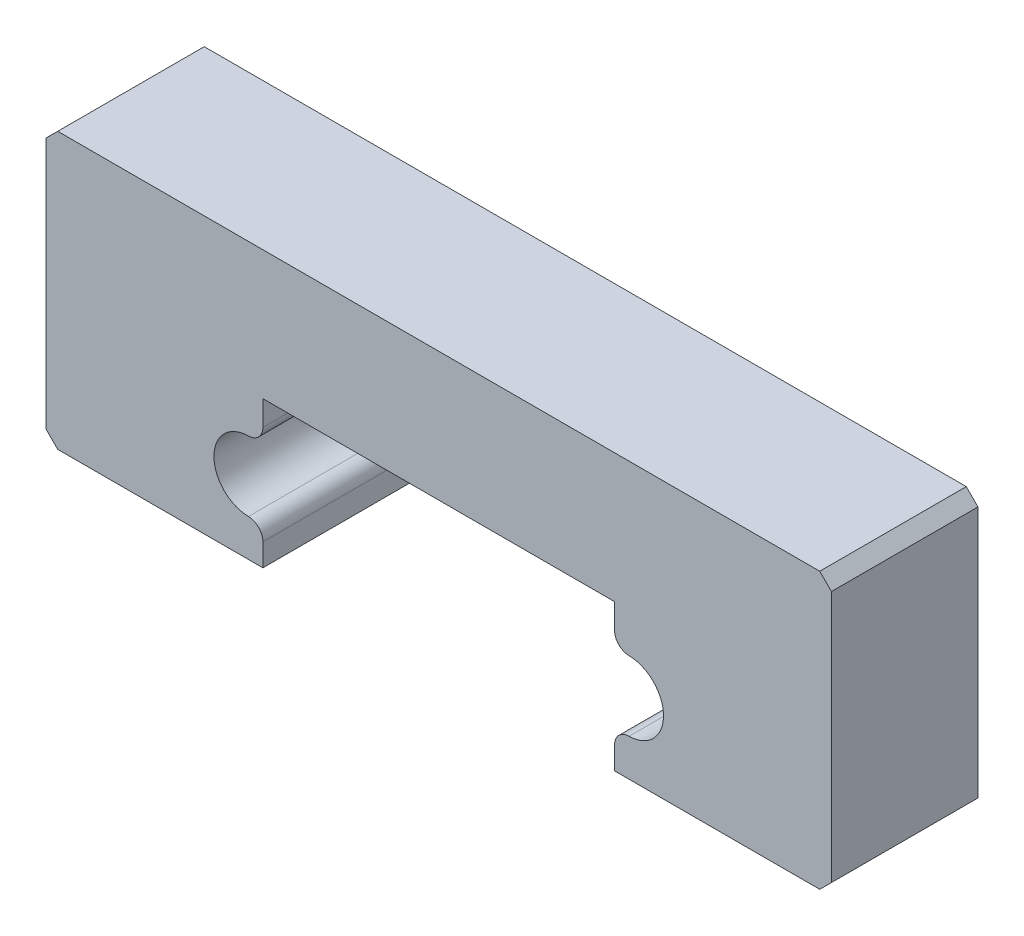
ISO-10303-21;
HEADER;
FILE_DESCRIPTION(('STEP AP214'),'2;1');
FILE_NAME('part.step','',(''),(''),'','','');
FILE_SCHEMA(('AUTOMOTIVE_DESIGN { 1 0 10303 214 1 1 1 1 }'));
ENDSEC;
DATA;
#1=APPLICATION_CONTEXT('core data for automotive mechanical design processes');
#2=APPLICATION_PROTOCOL_DEFINITION('international standard','automotive_design',2000,#1);
#3=PRODUCT_CONTEXT('',#1,'mechanical');
#4=PRODUCT('Part','Part','',(#3));
#5=PRODUCT_RELATED_PRODUCT_CATEGORY('part','',(#4));
#6=PRODUCT_DEFINITION_FORMATION('','',#4);
#7=PRODUCT_DEFINITION_CONTEXT('part definition',#1,'design');
#8=PRODUCT_DEFINITION('design','',#6,#7);
#9=PRODUCT_DEFINITION_SHAPE('','',#8);
#10=(LENGTH_UNIT() NAMED_UNIT(*) SI_UNIT(.MILLI.,.METRE.));
#11=(NAMED_UNIT(*) PLANE_ANGLE_UNIT() SI_UNIT($,.RADIAN.));
#12=(NAMED_UNIT(*) SI_UNIT($,.STERADIAN.) SOLID_ANGLE_UNIT());
#13=UNCERTAINTY_MEASURE_WITH_UNIT(LENGTH_MEASURE(1.E-05),#10,'distance_accuracy_value','');
#14=(GEOMETRIC_REPRESENTATION_CONTEXT(3) GLOBAL_UNCERTAINTY_ASSIGNED_CONTEXT((#13)) GLOBAL_UNIT_ASSIGNED_CONTEXT((#10,
#11,#12)) REPRESENTATION_CONTEXT('',''));
#15=CARTESIAN_POINT('',(0.,0.,0.));
#16=DIRECTION('',(0.,0.,1.));
#17=DIRECTION('',(1.,0.,0.));
#18=AXIS2_PLACEMENT_3D('',#15,#16,#17);
#19=CARTESIAN_POINT('',(-6.,-5.,5.));
#20=DIRECTION('',(-1.,0.,0.));
#21=DIRECTION('',(0.,-1.,0.));
#22=AXIS2_PLACEMENT_3D('',#19,#20,#21);
#23=PLANE('',#22);
#24=DIRECTION('',(0.,1.,0.));
#25=VECTOR('',#24,1.);
#26=CARTESIAN_POINT('',(-6.,-5.,0.));
#27=LINE('',#26,#25);
#28=CARTESIAN_POINT('',(-6.,-5.,0.));
#29=VERTEX_POINT('',#28);
#30=CARTESIAN_POINT('',(-6.,-4.22988165266092,0.));
#31=VERTEX_POINT('',#30);
#32=EDGE_CURVE('E247',#29,#31,#27,.T.);
#33=ORIENTED_EDGE('',*,*,#32,.T.);
#34=DIRECTION('',(0.,0.,-1.));
#35=VECTOR('',#34,1.);
#36=CARTESIAN_POINT('',(-6.,-4.22988165266092,5.));
#37=LINE('',#36,#35);
#38=CARTESIAN_POINT('',(-6.,-4.22988165266092,5.));
#39=VERTEX_POINT('',#38);
#40=EDGE_CURVE('E11',#31,#39,#37,.F.);
#41=ORIENTED_EDGE('',*,*,#40,.T.);
#42=DIRECTION('',(0.,1.,0.));
#43=VECTOR('',#42,1.);
#44=CARTESIAN_POINT('',(-6.,-5.,5.));
#45=LINE('',#44,#43);
#46=CARTESIAN_POINT('',(-6.,-5.,5.));
#47=VERTEX_POINT('',#46);
#48=EDGE_CURVE('E297',#47,#39,#45,.T.);
#49=ORIENTED_EDGE('',*,*,#48,.F.);
#50=DIRECTION('',(0.,0.,-1.));
#51=VECTOR('',#50,1.);
#52=CARTESIAN_POINT('',(-6.,-5.,5.));
#53=LINE('',#52,#51);
#54=EDGE_CURVE('E246',#47,#29,#53,.T.);
#55=ORIENTED_EDGE('',*,*,#54,.T.);
#56=EDGE_LOOP('',(#33,#41,#49,#55));
#57=FACE_BOUND('',#56,.T.);
#58=ADVANCED_FACE('F43',(#57),#23,.F.);
#59=CARTESIAN_POINT('',(-6.48,-2.54,5.));
#60=DIRECTION('',(0.,0.,-1.));
#61=DIRECTION('',(-1.,0.,0.));
#62=AXIS2_PLACEMENT_3D('',#59,#60,#61);
#63=CYLINDRICAL_SURFACE('',#62,1.19);
#64=CARTESIAN_POINT('',(-6.48,-2.54,0.));
#65=DIRECTION('',(0.,0.,-1.));
#66=DIRECTION('',(1.,0.,0.));
#67=AXIS2_PLACEMENT_3D('',#64,#65,#66);
#68=CIRCLE('',#67,1.19);
#69=CARTESIAN_POINT('',(-6.49408284023669,-3.72991666666657,0.));
#70=VERTEX_POINT('',#69);
#71=CARTESIAN_POINT('',(-6.49408284023669,-1.35008333333344,0.));
#72=VERTEX_POINT('',#71);
#73=EDGE_CURVE('E251',#70,#72,#68,.T.);
#74=ORIENTED_EDGE('',*,*,#73,.T.);
#75=DIRECTION('',(0.,0.,-1.));
#76=VECTOR('',#75,1.);
#77=CARTESIAN_POINT('',(-6.49408284023669,-1.35008333333344,5.));
#78=LINE('',#77,#76);
#79=CARTESIAN_POINT('',(-6.49408284023669,-1.35008333333344,5.));
#80=VERTEX_POINT('',#79);
#81=EDGE_CURVE('E52',#72,#80,#78,.F.);
#82=ORIENTED_EDGE('',*,*,#81,.T.);
#83=CARTESIAN_POINT('',(-6.48,-2.54,5.));
#84=DIRECTION('',(0.,0.,-1.));
#85=DIRECTION('',(1.,0.,0.));
#86=AXIS2_PLACEMENT_3D('',#83,#84,#85);
#87=CIRCLE('',#86,1.19);
#88=CARTESIAN_POINT('',(-6.49408284023669,-3.72991666666657,5.));
#89=VERTEX_POINT('',#88);
#90=EDGE_CURVE('E191',#89,#80,#87,.T.);
#91=ORIENTED_EDGE('',*,*,#90,.F.);
#92=DIRECTION('',(0.,0.,-1.));
#93=VECTOR('',#92,1.);
#94=CARTESIAN_POINT('',(-6.49408284023669,-3.72991666666657,5.));
#95=LINE('',#94,#93);
#96=EDGE_CURVE('E377',#89,#70,#95,.T.);
#97=ORIENTED_EDGE('',*,*,#96,.T.);
#98=EDGE_LOOP('',(#74,#82,#91,#97));
#99=FACE_BOUND('',#98,.T.);
#100=ADVANCED_FACE('F384',(#99),#63,.F.);
#101=CARTESIAN_POINT('',(-6.,0.,5.));
#102=DIRECTION('',(-1.,0.,0.));
#103=DIRECTION('',(0.,0.,1.));
#104=AXIS2_PLACEMENT_3D('',#101,#102,#103);
#105=PLANE('',#104);
#106=DIRECTION('',(0.,1.,0.));
#107=VECTOR('',#106,1.);
#108=CARTESIAN_POINT('',(-6.,0.,5.));
#109=LINE('',#108,#107);
#110=CARTESIAN_POINT('',(-6.,-0.850118347339082,5.));
#111=VERTEX_POINT('',#110);
#112=CARTESIAN_POINT('',(-6.,0.,5.));
#113=VERTEX_POINT('',#112);
#114=EDGE_CURVE('E180',#111,#113,#109,.T.);
#115=ORIENTED_EDGE('',*,*,#114,.F.);
#116=DIRECTION('',(0.,0.,-1.));
#117=VECTOR('',#116,1.);
#118=CARTESIAN_POINT('',(-6.,-0.850118347339082,5.));
#119=LINE('',#118,#117);
#120=CARTESIAN_POINT('',(-6.,-0.850118347339082,0.));
#121=VERTEX_POINT('',#120);
#122=EDGE_CURVE('E374',#111,#121,#119,.T.);
#123=ORIENTED_EDGE('',*,*,#122,.T.);
#124=DIRECTION('',(0.,1.,0.));
#125=VECTOR('',#124,1.);
#126=CARTESIAN_POINT('',(-6.,0.,0.));
#127=LINE('',#126,#125);
#128=CARTESIAN_POINT('',(-6.,0.,0.));
#129=VERTEX_POINT('',#128);
#130=EDGE_CURVE('E197',#121,#129,#127,.T.);
#131=ORIENTED_EDGE('',*,*,#130,.T.);
#132=DIRECTION('',(0.,0.,-1.));
#133=VECTOR('',#132,1.);
#134=CARTESIAN_POINT('',(-6.,0.,5.));
#135=LINE('',#134,#133);
#136=EDGE_CURVE('E194',#113,#129,#135,.T.);
#137=ORIENTED_EDGE('',*,*,#136,.F.);
#138=EDGE_LOOP('',(#115,#123,#131,#137));
#139=FACE_BOUND('',#138,.T.);
#140=ADVANCED_FACE('F195',(#139),#105,.F.);
#141=CARTESIAN_POINT('',(6.,0.,5.));
#142=DIRECTION('',(0.,1.,0.));
#143=DIRECTION('',(-1.,0.,0.));
#144=AXIS2_PLACEMENT_3D('',#141,#142,#143);
#145=PLANE('',#144);
#146=DIRECTION('',(1.,0.,0.));
#147=VECTOR('',#146,1.);
#148=CARTESIAN_POINT('',(6.,0.,0.));
#149=LINE('',#148,#147);
#150=CARTESIAN_POINT('',(6.,0.,0.));
#151=VERTEX_POINT('',#150);
#152=EDGE_CURVE('E257',#129,#151,#149,.T.);
#153=ORIENTED_EDGE('',*,*,#152,.T.);
#154=DIRECTION('',(0.,0.,-1.));
#155=VECTOR('',#154,1.);
#156=CARTESIAN_POINT('',(6.,0.,5.));
#157=LINE('',#156,#155);
#158=CARTESIAN_POINT('',(6.,0.,5.));
#159=VERTEX_POINT('',#158);
#160=EDGE_CURVE('E202',#159,#151,#157,.T.);
#161=ORIENTED_EDGE('',*,*,#160,.F.);
#162=DIRECTION('',(1.,0.,0.));
#163=VECTOR('',#162,1.);
#164=CARTESIAN_POINT('',(6.,0.,5.));
#165=LINE('',#164,#163);
#166=EDGE_CURVE('E185',#113,#159,#165,.T.);
#167=ORIENTED_EDGE('',*,*,#166,.F.);
#168=ORIENTED_EDGE('',*,*,#136,.T.);
#169=EDGE_LOOP('',(#153,#161,#167,#168));
#170=FACE_BOUND('',#169,.T.);
#171=ADVANCED_FACE('F204',(#170),#145,.F.);
#172=CARTESIAN_POINT('',(6.,0.,5.));
#173=DIRECTION('',(1.,0.,0.));
#174=DIRECTION('',(0.,0.,-1.));
#175=AXIS2_PLACEMENT_3D('',#172,#173,#174);
#176=PLANE('',#175);
#177=DIRECTION('',(0.,-1.,0.));
#178=VECTOR('',#177,1.);
#179=CARTESIAN_POINT('',(6.,0.,0.));
#180=LINE('',#179,#178);
#181=CARTESIAN_POINT('',(6.,-0.850118347339077,0.));
#182=VERTEX_POINT('',#181);
#183=EDGE_CURVE('E260',#151,#182,#180,.T.);
#184=ORIENTED_EDGE('',*,*,#183,.T.);
#185=DIRECTION('',(0.,0.,-1.));
#186=VECTOR('',#185,1.);
#187=CARTESIAN_POINT('',(6.,-0.850118347339077,5.));
#188=LINE('',#187,#186);
#189=CARTESIAN_POINT('',(6.,-0.850118347339077,5.));
#190=VERTEX_POINT('',#189);
#191=EDGE_CURVE('E59',#182,#190,#188,.F.);
#192=ORIENTED_EDGE('',*,*,#191,.T.);
#193=DIRECTION('',(0.,-1.,0.));
#194=VECTOR('',#193,1.);
#195=CARTESIAN_POINT('',(6.,0.,5.));
#196=LINE('',#195,#194);
#197=EDGE_CURVE('E207',#159,#190,#196,.T.);
#198=ORIENTED_EDGE('',*,*,#197,.F.);
#199=ORIENTED_EDGE('',*,*,#160,.T.);
#200=EDGE_LOOP('',(#184,#192,#198,#199));
#201=FACE_BOUND('',#200,.T.);
#202=ADVANCED_FACE('F396',(#201),#176,.F.);
#203=CARTESIAN_POINT('',(6.48,-2.54,5.));
#204=DIRECTION('',(0.,0.,-1.));
#205=DIRECTION('',(-1.,0.,0.));
#206=AXIS2_PLACEMENT_3D('',#203,#204,#205);
#207=CYLINDRICAL_SURFACE('',#206,1.19);
#208=CARTESIAN_POINT('',(6.48,-2.54,0.));
#209=DIRECTION('',(0.,0.,-1.));
#210=DIRECTION('',(-1.,0.,0.));
#211=AXIS2_PLACEMENT_3D('',#208,#209,#210);
#212=CIRCLE('',#211,1.19);
#213=CARTESIAN_POINT('',(6.49408284023669,-1.35008333333343,0.));
#214=VERTEX_POINT('',#213);
#215=CARTESIAN_POINT('',(6.49408284023669,-3.72991666666656,0.));
#216=VERTEX_POINT('',#215);
#217=EDGE_CURVE('E263',#214,#216,#212,.T.);
#218=ORIENTED_EDGE('',*,*,#217,.T.);
#219=DIRECTION('',(0.,0.,-1.));
#220=VECTOR('',#219,1.);
#221=CARTESIAN_POINT('',(6.49408284023669,-3.72991666666656,5.));
#222=LINE('',#221,#220);
#223=CARTESIAN_POINT('',(6.49408284023669,-3.72991666666656,5.));
#224=VERTEX_POINT('',#223);
#225=EDGE_CURVE('E358',#216,#224,#222,.F.);
#226=ORIENTED_EDGE('',*,*,#225,.T.);
#227=CARTESIAN_POINT('',(6.48,-2.54,5.));
#228=DIRECTION('',(0.,0.,-1.));
#229=DIRECTION('',(-1.,0.,0.));
#230=AXIS2_PLACEMENT_3D('',#227,#228,#229);
#231=CIRCLE('',#230,1.19);
#232=CARTESIAN_POINT('',(6.49408284023669,-1.35008333333343,5.));
#233=VERTEX_POINT('',#232);
#234=EDGE_CURVE('E210',#233,#224,#231,.T.);
#235=ORIENTED_EDGE('',*,*,#234,.F.);
#236=DIRECTION('',(0.,0.,-1.));
#237=VECTOR('',#236,1.);
#238=CARTESIAN_POINT('',(6.49408284023669,-1.35008333333343,5.));
#239=LINE('',#238,#237);
#240=EDGE_CURVE('E354',#233,#214,#239,.T.);
#241=ORIENTED_EDGE('',*,*,#240,.T.);
#242=EDGE_LOOP('',(#218,#226,#235,#241));
#243=FACE_BOUND('',#242,.T.);
#244=ADVANCED_FACE('F404',(#243),#207,.F.);
#245=CARTESIAN_POINT('',(6.,-5.,5.));
#246=DIRECTION('',(1.,0.,0.));
#247=DIRECTION('',(0.,1.,0.));
#248=AXIS2_PLACEMENT_3D('',#245,#246,#247);
#249=PLANE('',#248);
#250=DIRECTION('',(0.,-1.,0.));
#251=VECTOR('',#250,1.);
#252=CARTESIAN_POINT('',(6.,-5.,5.));
#253=LINE('',#252,#251);
#254=CARTESIAN_POINT('',(6.,-4.22988165266092,5.));
#255=VERTEX_POINT('',#254);
#256=CARTESIAN_POINT('',(6.,-5.,5.));
#257=VERTEX_POINT('',#256);
#258=EDGE_CURVE('E216',#255,#257,#253,.T.);
#259=ORIENTED_EDGE('',*,*,#258,.F.);
#260=DIRECTION('',(0.,0.,-1.));
#261=VECTOR('',#260,1.);
#262=CARTESIAN_POINT('',(6.,-4.22988165266092,5.));
#263=LINE('',#262,#261);
#264=CARTESIAN_POINT('',(6.,-4.22988165266092,0.));
#265=VERTEX_POINT('',#264);
#266=EDGE_CURVE('E201',#255,#265,#263,.T.);
#267=ORIENTED_EDGE('',*,*,#266,.T.);
#268=DIRECTION('',(0.,-1.,0.));
#269=VECTOR('',#268,1.);
#270=CARTESIAN_POINT('',(6.,-5.,0.));
#271=LINE('',#270,#269);
#272=CARTESIAN_POINT('',(6.,-5.,0.));
#273=VERTEX_POINT('',#272);
#274=EDGE_CURVE('E267',#265,#273,#271,.T.);
#275=ORIENTED_EDGE('',*,*,#274,.T.);
#276=DIRECTION('',(0.,0.,-1.));
#277=VECTOR('',#276,1.);
#278=CARTESIAN_POINT('',(6.,-5.,5.));
#279=LINE('',#278,#277);
#280=EDGE_CURVE('E333',#257,#273,#279,.T.);
#281=ORIENTED_EDGE('',*,*,#280,.F.);
#282=EDGE_LOOP('',(#259,#267,#275,#281));
#283=FACE_BOUND('',#282,.T.);
#284=ADVANCED_FACE('F413',(#283),#249,.F.);
#285=CARTESIAN_POINT('',(6.,-5.,5.));
#286=DIRECTION('',(0.,1.,0.));
#287=DIRECTION('',(-1.,0.,0.));
#288=AXIS2_PLACEMENT_3D('',#285,#286,#287);
#289=PLANE('',#288);
#290=DIRECTION('',(1.,0.,0.));
#291=VECTOR('',#290,1.);
#292=CARTESIAN_POINT('',(6.,-5.,0.));
#293=LINE('',#292,#291);
#294=CARTESIAN_POINT('',(13.,-4.99999999999999,0.));
#295=VERTEX_POINT('',#294);
#296=EDGE_CURVE('E270',#273,#295,#293,.T.);
#297=ORIENTED_EDGE('',*,*,#296,.T.);
#298=DIRECTION('',(0.,0.,-1.));
#299=VECTOR('',#298,1.);
#300=CARTESIAN_POINT('',(13.,-4.99999999999999,5.));
#301=LINE('',#300,#299);
#302=CARTESIAN_POINT('',(13.,-4.99999999999999,5.));
#303=VERTEX_POINT('',#302);
#304=EDGE_CURVE('E329',#303,#295,#301,.T.);
#305=ORIENTED_EDGE('',*,*,#304,.F.);
#306=DIRECTION('',(1.,0.,0.));
#307=VECTOR('',#306,1.);
#308=CARTESIAN_POINT('',(6.,-5.,5.));
#309=LINE('',#308,#307);
#310=EDGE_CURVE('E219',#257,#303,#309,.T.);
#311=ORIENTED_EDGE('',*,*,#310,.F.);
#312=ORIENTED_EDGE('',*,*,#280,.T.);
#313=EDGE_LOOP('',(#297,#305,#311,#312));
#314=FACE_BOUND('',#313,.T.);
#315=ADVANCED_FACE('F420',(#314),#289,.F.);
#316=CARTESIAN_POINT('',(13.,-4.99999999999999,5.));
#317=DIRECTION('',(-0.707106781186548,0.707106781186548,0.));
#318=DIRECTION('',(-0.707106781186548,-0.707106781186548,0.));
#319=AXIS2_PLACEMENT_3D('',#316,#317,#318);
#320=PLANE('',#319);
#321=DIRECTION('',(0.707106781186547,0.707106781186547,0.));
#322=VECTOR('',#321,1.);
#323=CARTESIAN_POINT('',(13.,-4.99999999999999,0.));
#324=LINE('',#323,#322);
#325=CARTESIAN_POINT('',(13.4,-4.59999999999999,0.));
#326=VERTEX_POINT('',#325);
#327=EDGE_CURVE('E273',#295,#326,#324,.T.);
#328=ORIENTED_EDGE('',*,*,#327,.T.);
#329=DIRECTION('',(0.,0.,-1.));
#330=VECTOR('',#329,1.);
#331=CARTESIAN_POINT('',(13.4,-4.59999999999999,5.));
#332=LINE('',#331,#330);
#333=CARTESIAN_POINT('',(13.4,-4.59999999999999,5.));
#334=VERTEX_POINT('',#333);
#335=EDGE_CURVE('E325',#334,#326,#332,.T.);
#336=ORIENTED_EDGE('',*,*,#335,.F.);
#337=DIRECTION('',(0.707106781186547,0.707106781186547,0.));
#338=VECTOR('',#337,1.);
#339=CARTESIAN_POINT('',(13.,-4.99999999999999,5.));
#340=LINE('',#339,#338);
#341=EDGE_CURVE('E222',#303,#334,#340,.T.);
#342=ORIENTED_EDGE('',*,*,#341,.F.);
#343=ORIENTED_EDGE('',*,*,#304,.T.);
#344=EDGE_LOOP('',(#328,#336,#342,#343));
#345=FACE_BOUND('',#344,.T.);
#346=ADVANCED_FACE('F423',(#345),#320,.F.);
#347=CARTESIAN_POINT('',(13.4,-4.59999999999999,5.));
#348=DIRECTION('',(-1.,0.,0.));
#349=DIRECTION('',(0.,-1.,0.));
#350=AXIS2_PLACEMENT_3D('',#347,#348,#349);
#351=PLANE('',#350);
#352=DIRECTION('',(0.,1.,0.));
#353=VECTOR('',#352,1.);
#354=CARTESIAN_POINT('',(13.4,-4.59999999999999,0.));
#355=LINE('',#354,#353);
#356=CARTESIAN_POINT('',(13.4,4.00000000000001,0.));
#357=VERTEX_POINT('',#356);
#358=EDGE_CURVE('E276',#326,#357,#355,.T.);
#359=ORIENTED_EDGE('',*,*,#358,.T.);
#360=DIRECTION('',(0.,0.,-1.));
#361=VECTOR('',#360,1.);
#362=CARTESIAN_POINT('',(13.4,4.00000000000001,5.));
#363=LINE('',#362,#361);
#364=CARTESIAN_POINT('',(13.4,4.00000000000001,5.));
#365=VERTEX_POINT('',#364);
#366=EDGE_CURVE('E321',#365,#357,#363,.T.);
#367=ORIENTED_EDGE('',*,*,#366,.F.);
#368=DIRECTION('',(0.,1.,0.));
#369=VECTOR('',#368,1.);
#370=CARTESIAN_POINT('',(13.4,-4.59999999999999,5.));
#371=LINE('',#370,#369);
#372=EDGE_CURVE('E225',#334,#365,#371,.T.);
#373=ORIENTED_EDGE('',*,*,#372,.F.);
#374=ORIENTED_EDGE('',*,*,#335,.T.);
#375=EDGE_LOOP('',(#359,#367,#373,#374));
#376=FACE_BOUND('',#375,.T.);
#377=ADVANCED_FACE('F428',(#376),#351,.F.);
#378=CARTESIAN_POINT('',(13.4,4.00000000000001,5.));
#379=DIRECTION('',(-0.707106781186548,-0.707106781186548,0.));
#380=DIRECTION('',(0.707106781186548,-0.707106781186548,0.));
#381=AXIS2_PLACEMENT_3D('',#378,#379,#380);
#382=PLANE('',#381);
#383=DIRECTION('',(-0.707106781186547,0.707106781186547,0.));
#384=VECTOR('',#383,1.);
#385=CARTESIAN_POINT('',(13.4,4.00000000000001,0.));
#386=LINE('',#385,#384);
#387=CARTESIAN_POINT('',(13.,4.40000000000001,0.));
#388=VERTEX_POINT('',#387);
#389=EDGE_CURVE('E279',#357,#388,#386,.T.);
#390=ORIENTED_EDGE('',*,*,#389,.T.);
#391=DIRECTION('',(0.,0.,-1.));
#392=VECTOR('',#391,1.);
#393=CARTESIAN_POINT('',(13.,4.40000000000001,5.));
#394=LINE('',#393,#392);
#395=CARTESIAN_POINT('',(13.,4.40000000000001,5.));
#396=VERTEX_POINT('',#395);
#397=EDGE_CURVE('E317',#396,#388,#394,.T.);
#398=ORIENTED_EDGE('',*,*,#397,.F.);
#399=DIRECTION('',(-0.707106781186547,0.707106781186547,0.));
#400=VECTOR('',#399,1.);
#401=CARTESIAN_POINT('',(13.4,4.00000000000001,5.));
#402=LINE('',#401,#400);
#403=EDGE_CURVE('E228',#365,#396,#402,.T.);
#404=ORIENTED_EDGE('',*,*,#403,.F.);
#405=ORIENTED_EDGE('',*,*,#366,.T.);
#406=EDGE_LOOP('',(#390,#398,#404,#405));
#407=FACE_BOUND('',#406,.T.);
#408=ADVANCED_FACE('F434',(#407),#382,.F.);
#409=CARTESIAN_POINT('',(-13.,4.4,5.));
#410=DIRECTION('',(0.,-1.,0.));
#411=DIRECTION('',(1.,0.,0.));
#412=AXIS2_PLACEMENT_3D('',#409,#410,#411);
#413=PLANE('',#412);
#414=DIRECTION('',(-1.,0.,0.));
#415=VECTOR('',#414,1.);
#416=CARTESIAN_POINT('',(-13.,4.4,0.));
#417=LINE('',#416,#415);
#418=CARTESIAN_POINT('',(-13.,4.4,0.));
#419=VERTEX_POINT('',#418);
#420=EDGE_CURVE('E282',#388,#419,#417,.T.);
#421=ORIENTED_EDGE('',*,*,#420,.T.);
#422=DIRECTION('',(0.,0.,-1.));
#423=VECTOR('',#422,1.);
#424=CARTESIAN_POINT('',(-13.,4.4,5.));
#425=LINE('',#424,#423);
#426=CARTESIAN_POINT('',(-13.,4.4,5.));
#427=VERTEX_POINT('',#426);
#428=EDGE_CURVE('E313',#427,#419,#425,.T.);
#429=ORIENTED_EDGE('',*,*,#428,.F.);
#430=DIRECTION('',(-1.,0.,0.));
#431=VECTOR('',#430,1.);
#432=CARTESIAN_POINT('',(-13.,4.4,5.));
#433=LINE('',#432,#431);
#434=EDGE_CURVE('E231',#396,#427,#433,.T.);
#435=ORIENTED_EDGE('',*,*,#434,.F.);
#436=ORIENTED_EDGE('',*,*,#397,.T.);
#437=EDGE_LOOP('',(#421,#429,#435,#436));
#438=FACE_BOUND('',#437,.T.);
#439=ADVANCED_FACE('F438',(#438),#413,.F.);
#440=CARTESIAN_POINT('',(-13.4,4.,5.));
#441=DIRECTION('',(0.707106781186548,-0.707106781186547,0.));
#442=DIRECTION('',(0.707106781186547,0.707106781186548,0.));
#443=AXIS2_PLACEMENT_3D('',#440,#441,#442);
#444=PLANE('',#443);
#445=DIRECTION('',(-0.707106781186547,-0.707106781186548,0.));
#446=VECTOR('',#445,1.);
#447=CARTESIAN_POINT('',(-13.4,4.,0.));
#448=LINE('',#447,#446);
#449=CARTESIAN_POINT('',(-13.4,4.,0.));
#450=VERTEX_POINT('',#449);
#451=EDGE_CURVE('E285',#419,#450,#448,.T.);
#452=ORIENTED_EDGE('',*,*,#451,.T.);
#453=DIRECTION('',(0.,0.,-1.));
#454=VECTOR('',#453,1.);
#455=CARTESIAN_POINT('',(-13.4,4.,5.));
#456=LINE('',#455,#454);
#457=CARTESIAN_POINT('',(-13.4,4.,5.));
#458=VERTEX_POINT('',#457);
#459=EDGE_CURVE('E309',#458,#450,#456,.T.);
#460=ORIENTED_EDGE('',*,*,#459,.F.);
#461=DIRECTION('',(-0.707106781186547,-0.707106781186548,0.));
#462=VECTOR('',#461,1.);
#463=CARTESIAN_POINT('',(-13.4,4.,5.));
#464=LINE('',#463,#462);
#465=EDGE_CURVE('E234',#427,#458,#464,.T.);
#466=ORIENTED_EDGE('',*,*,#465,.F.);
#467=ORIENTED_EDGE('',*,*,#428,.T.);
#468=EDGE_LOOP('',(#452,#460,#466,#467));
#469=FACE_BOUND('',#468,.T.);
#470=ADVANCED_FACE('F443',(#469),#444,.F.);
#471=CARTESIAN_POINT('',(-13.4,-4.6,5.));
#472=DIRECTION('',(1.,0.,0.));
#473=DIRECTION('',(0.,0.,-1.));
#474=AXIS2_PLACEMENT_3D('',#471,#472,#473);
#475=PLANE('',#474);
#476=DIRECTION('',(0.,-1.,0.));
#477=VECTOR('',#476,1.);
#478=CARTESIAN_POINT('',(-13.4,-4.6,0.));
#479=LINE('',#478,#477);
#480=CARTESIAN_POINT('',(-13.4,-4.6,0.));
#481=VERTEX_POINT('',#480);
#482=EDGE_CURVE('E288',#450,#481,#479,.T.);
#483=ORIENTED_EDGE('',*,*,#482,.T.);
#484=DIRECTION('',(0.,0.,-1.));
#485=VECTOR('',#484,1.);
#486=CARTESIAN_POINT('',(-13.4,-4.6,5.));
#487=LINE('',#486,#485);
#488=CARTESIAN_POINT('',(-13.4,-4.6,5.));
#489=VERTEX_POINT('',#488);
#490=EDGE_CURVE('E305',#489,#481,#487,.T.);
#491=ORIENTED_EDGE('',*,*,#490,.F.);
#492=DIRECTION('',(0.,-1.,0.));
#493=VECTOR('',#492,1.);
#494=CARTESIAN_POINT('',(-13.4,-4.6,5.));
#495=LINE('',#494,#493);
#496=EDGE_CURVE('E237',#458,#489,#495,.T.);
#497=ORIENTED_EDGE('',*,*,#496,.F.);
#498=ORIENTED_EDGE('',*,*,#459,.T.);
#499=EDGE_LOOP('',(#483,#491,#497,#498));
#500=FACE_BOUND('',#499,.T.);
#501=ADVANCED_FACE('F449',(#500),#475,.F.);
#502=CARTESIAN_POINT('',(-13.,-5.,5.));
#503=DIRECTION('',(0.707106781186548,0.707106781186548,0.));
#504=DIRECTION('',(-0.707106781186548,0.707106781186548,0.));
#505=AXIS2_PLACEMENT_3D('',#502,#503,#504);
#506=PLANE('',#505);
#507=DIRECTION('',(0.707106781186547,-0.707106781186547,0.));
#508=VECTOR('',#507,1.);
#509=CARTESIAN_POINT('',(-13.,-5.,0.));
#510=LINE('',#509,#508);
#511=CARTESIAN_POINT('',(-13.,-5.,0.));
#512=VERTEX_POINT('',#511);
#513=EDGE_CURVE('E291',#481,#512,#510,.T.);
#514=ORIENTED_EDGE('',*,*,#513,.T.);
#515=DIRECTION('',(0.,0.,-1.));
#516=VECTOR('',#515,1.);
#517=CARTESIAN_POINT('',(-13.,-5.,5.));
#518=LINE('',#517,#516);
#519=CARTESIAN_POINT('',(-13.,-5.,5.));
#520=VERTEX_POINT('',#519);
#521=EDGE_CURVE('E301',#520,#512,#518,.T.);
#522=ORIENTED_EDGE('',*,*,#521,.F.);
#523=DIRECTION('',(0.707106781186547,-0.707106781186547,0.));
#524=VECTOR('',#523,1.);
#525=CARTESIAN_POINT('',(-13.,-5.,5.));
#526=LINE('',#525,#524);
#527=EDGE_CURVE('E240',#489,#520,#526,.T.);
#528=ORIENTED_EDGE('',*,*,#527,.F.);
#529=ORIENTED_EDGE('',*,*,#490,.T.);
#530=EDGE_LOOP('',(#514,#522,#528,#529));
#531=FACE_BOUND('',#530,.T.);
#532=ADVANCED_FACE('F453',(#531),#506,.F.);
#533=CARTESIAN_POINT('',(-6.,-5.,5.));
#534=DIRECTION('',(0.,1.,0.));
#535=DIRECTION('',(-1.,0.,0.));
#536=AXIS2_PLACEMENT_3D('',#533,#534,#535);
#537=PLANE('',#536);
#538=DIRECTION('',(1.,0.,0.));
#539=VECTOR('',#538,1.);
#540=CARTESIAN_POINT('',(-6.,-5.,0.));
#541=LINE('',#540,#539);
#542=EDGE_CURVE('E294',#512,#29,#541,.T.);
#543=ORIENTED_EDGE('',*,*,#542,.T.);
#544=ORIENTED_EDGE('',*,*,#54,.F.);
#545=DIRECTION('',(1.,0.,0.));
#546=VECTOR('',#545,1.);
#547=CARTESIAN_POINT('',(-6.,-5.,5.));
#548=LINE('',#547,#546);
#549=EDGE_CURVE('E243',#520,#47,#548,.T.);
#550=ORIENTED_EDGE('',*,*,#549,.F.);
#551=ORIENTED_EDGE('',*,*,#521,.T.);
#552=EDGE_LOOP('',(#543,#544,#550,#551));
#553=FACE_BOUND('',#552,.T.);
#554=ADVANCED_FACE('F458',(#553),#537,.F.);
#555=CARTESIAN_POINT('',(-6.48,-2.54,5.));
#556=DIRECTION('',(0.,0.,1.));
#557=DIRECTION('',(1.,0.,0.));
#558=AXIS2_PLACEMENT_3D('',#555,#556,#557);
#559=PLANE('',#558);
#560=ORIENTED_EDGE('',*,*,#234,.T.);
#561=CARTESIAN_POINT('',(6.5,-4.22988165266092,5.));
#562=DIRECTION('',(0.,0.,1.));
#563=DIRECTION('',(1.,0.,0.));
#564=AXIS2_PLACEMENT_3D('',#561,#562,#563);
#565=CIRCLE('',#564,0.5);
#566=EDGE_CURVE('E369',#224,#255,#565,.T.);
#567=ORIENTED_EDGE('',*,*,#566,.T.);
#568=ORIENTED_EDGE('',*,*,#258,.T.);
#569=ORIENTED_EDGE('',*,*,#310,.T.);
#570=ORIENTED_EDGE('',*,*,#341,.T.);
#571=ORIENTED_EDGE('',*,*,#372,.T.);
#572=ORIENTED_EDGE('',*,*,#403,.T.);
#573=ORIENTED_EDGE('',*,*,#434,.T.);
#574=ORIENTED_EDGE('',*,*,#465,.T.);
#575=ORIENTED_EDGE('',*,*,#496,.T.);
#576=ORIENTED_EDGE('',*,*,#527,.T.);
#577=ORIENTED_EDGE('',*,*,#549,.T.);
#578=ORIENTED_EDGE('',*,*,#48,.T.);
#579=CARTESIAN_POINT('',(-6.5,-4.22988165266092,5.));
#580=DIRECTION('',(0.,0.,1.));
#581=DIRECTION('',(1.,0.,0.));
#582=AXIS2_PLACEMENT_3D('',#579,#580,#581);
#583=CIRCLE('',#582,0.5);
#584=EDGE_CURVE('E361',#39,#89,#583,.T.);
#585=ORIENTED_EDGE('',*,*,#584,.T.);
#586=ORIENTED_EDGE('',*,*,#90,.T.);
#587=CARTESIAN_POINT('',(-6.5,-0.850118347339082,5.));
#588=DIRECTION('',(0.,0.,1.));
#589=DIRECTION('',(1.,0.,0.));
#590=AXIS2_PLACEMENT_3D('',#587,#588,#589);
#591=CIRCLE('',#590,0.5);
#592=EDGE_CURVE('E67',#80,#111,#591,.T.);
#593=ORIENTED_EDGE('',*,*,#592,.T.);
#594=ORIENTED_EDGE('',*,*,#114,.T.);
#595=ORIENTED_EDGE('',*,*,#166,.T.);
#596=ORIENTED_EDGE('',*,*,#197,.T.);
#597=CARTESIAN_POINT('',(6.5,-0.850118347339077,5.));
#598=DIRECTION('',(0.,0.,1.));
#599=DIRECTION('',(1.,0.,0.));
#600=AXIS2_PLACEMENT_3D('',#597,#598,#599);
#601=CIRCLE('',#600,0.5);
#602=EDGE_CURVE('E366',#190,#233,#601,.T.);
#603=ORIENTED_EDGE('',*,*,#602,.T.);
#604=EDGE_LOOP('',(#560,#567,#568,#569,#570,#571,#572,#573,#574,#575,#576,#577,#578,#585,#586,
#593,#594,#595,#596,#603));
#605=FACE_BOUND('',#604,.T.);
#606=ADVANCED_FACE('F183',(#605),#559,.T.);
#607=CARTESIAN_POINT('',(-6.48,-2.54,0.));
#608=DIRECTION('',(0.,0.,1.));
#609=DIRECTION('',(1.,0.,0.));
#610=AXIS2_PLACEMENT_3D('',#607,#608,#609);
#611=PLANE('',#610);
#612=ORIENTED_EDGE('',*,*,#274,.F.);
#613=CARTESIAN_POINT('',(6.5,-4.22988165266092,0.));
#614=DIRECTION('',(0.,0.,1.));
#615=DIRECTION('',(1.,0.,0.));
#616=AXIS2_PLACEMENT_3D('',#613,#614,#615);
#617=CIRCLE('',#616,0.5);
#618=EDGE_CURVE('E351',#265,#216,#617,.F.);
#619=ORIENTED_EDGE('',*,*,#618,.T.);
#620=ORIENTED_EDGE('',*,*,#217,.F.);
#621=CARTESIAN_POINT('',(6.5,-0.850118347339077,0.));
#622=DIRECTION('',(0.,0.,1.));
#623=DIRECTION('',(1.,0.,0.));
#624=AXIS2_PLACEMENT_3D('',#621,#622,#623);
#625=CIRCLE('',#624,0.5);
#626=EDGE_CURVE('E348',#214,#182,#625,.F.);
#627=ORIENTED_EDGE('',*,*,#626,.T.);
#628=ORIENTED_EDGE('',*,*,#183,.F.);
#629=ORIENTED_EDGE('',*,*,#152,.F.);
#630=ORIENTED_EDGE('',*,*,#130,.F.);
#631=CARTESIAN_POINT('',(-6.5,-0.850118347339082,0.));
#632=DIRECTION('',(0.,0.,1.));
#633=DIRECTION('',(1.,0.,0.));
#634=AXIS2_PLACEMENT_3D('',#631,#632,#633);
#635=CIRCLE('',#634,0.5);
#636=EDGE_CURVE('E345',#121,#72,#635,.F.);
#637=ORIENTED_EDGE('',*,*,#636,.T.);
#638=ORIENTED_EDGE('',*,*,#73,.F.);
#639=CARTESIAN_POINT('',(-6.5,-4.22988165266092,0.));
#640=DIRECTION('',(0.,0.,1.));
#641=DIRECTION('',(1.,0.,0.));
#642=AXIS2_PLACEMENT_3D('',#639,#640,#641);
#643=CIRCLE('',#642,0.5);
#644=EDGE_CURVE('E342',#70,#31,#643,.F.);
#645=ORIENTED_EDGE('',*,*,#644,.T.);
#646=ORIENTED_EDGE('',*,*,#32,.F.);
#647=ORIENTED_EDGE('',*,*,#542,.F.);
#648=ORIENTED_EDGE('',*,*,#513,.F.);
#649=ORIENTED_EDGE('',*,*,#482,.F.);
#650=ORIENTED_EDGE('',*,*,#451,.F.);
#651=ORIENTED_EDGE('',*,*,#420,.F.);
#652=ORIENTED_EDGE('',*,*,#389,.F.);
#653=ORIENTED_EDGE('',*,*,#358,.F.);
#654=ORIENTED_EDGE('',*,*,#327,.F.);
#655=ORIENTED_EDGE('',*,*,#296,.F.);
#656=EDGE_LOOP('',(#612,#619,#620,#627,#628,#629,#630,#637,#638,#645,#646,#647,#648,#649,#650,
#651,#652,#653,#654,#655));
#657=FACE_BOUND('',#656,.T.);
#658=ADVANCED_FACE('F394',(#657),#611,.F.);
#659=CARTESIAN_POINT('',(6.5,-4.22988165266092,5.));
#660=DIRECTION('',(0.,0.,-1.));
#661=DIRECTION('',(-1.,0.,0.));
#662=AXIS2_PLACEMENT_3D('',#659,#660,#661);
#663=CYLINDRICAL_SURFACE('',#662,0.5);
#664=ORIENTED_EDGE('',*,*,#566,.F.);
#665=ORIENTED_EDGE('',*,*,#225,.F.);
#666=ORIENTED_EDGE('',*,*,#618,.F.);
#667=ORIENTED_EDGE('',*,*,#266,.F.);
#668=EDGE_LOOP('',(#664,#665,#666,#667));
#669=FACE_BOUND('',#668,.T.);
#670=ADVANCED_FACE('F410',(#669),#663,.T.);
#671=CARTESIAN_POINT('',(6.5,-0.850118347339077,5.));
#672=DIRECTION('',(0.,0.,-1.));
#673=DIRECTION('',(-1.,0.,0.));
#674=AXIS2_PLACEMENT_3D('',#671,#672,#673);
#675=CYLINDRICAL_SURFACE('',#674,0.5);
#676=ORIENTED_EDGE('',*,*,#602,.F.);
#677=ORIENTED_EDGE('',*,*,#191,.F.);
#678=ORIENTED_EDGE('',*,*,#626,.F.);
#679=ORIENTED_EDGE('',*,*,#240,.F.);
#680=EDGE_LOOP('',(#676,#677,#678,#679));
#681=FACE_BOUND('',#680,.T.);
#682=ADVANCED_FACE('F401',(#681),#675,.T.);
#683=CARTESIAN_POINT('',(-6.5,-0.850118347339082,5.));
#684=DIRECTION('',(0.,0.,-1.));
#685=DIRECTION('',(-1.,0.,0.));
#686=AXIS2_PLACEMENT_3D('',#683,#684,#685);
#687=CYLINDRICAL_SURFACE('',#686,0.5);
#688=ORIENTED_EDGE('',*,*,#592,.F.);
#689=ORIENTED_EDGE('',*,*,#81,.F.);
#690=ORIENTED_EDGE('',*,*,#636,.F.);
#691=ORIENTED_EDGE('',*,*,#122,.F.);
#692=EDGE_LOOP('',(#688,#689,#690,#691));
#693=FACE_BOUND('',#692,.T.);
#694=ADVANCED_FACE('F391',(#693),#687,.T.);
#695=CARTESIAN_POINT('',(-6.5,-4.22988165266092,5.));
#696=DIRECTION('',(0.,0.,-1.));
#697=DIRECTION('',(-1.,0.,0.));
#698=AXIS2_PLACEMENT_3D('',#695,#696,#697);
#699=CYLINDRICAL_SURFACE('',#698,0.5);
#700=ORIENTED_EDGE('',*,*,#584,.F.);
#701=ORIENTED_EDGE('',*,*,#40,.F.);
#702=ORIENTED_EDGE('',*,*,#644,.F.);
#703=ORIENTED_EDGE('',*,*,#96,.F.);
#704=EDGE_LOOP('',(#700,#701,#702,#703));
#705=FACE_BOUND('',#704,.T.);
#706=ADVANCED_FACE('F45',(#705),#699,.T.);
#707=CLOSED_SHELL('',(#58,#100,#140,#171,#202,#244,#284,#315,#346,#377,#408,#439,#470,#501,#532,
#554,#606,#658,#670,#682,#694,#706));
#708=MANIFOLD_SOLID_BREP('B2',#707);
#709=ADVANCED_BREP_SHAPE_REPRESENTATION('',(#18,#708),#14);
#710=SHAPE_DEFINITION_REPRESENTATION(#9,#709);
ENDSEC;
END-ISO-10303-21;
